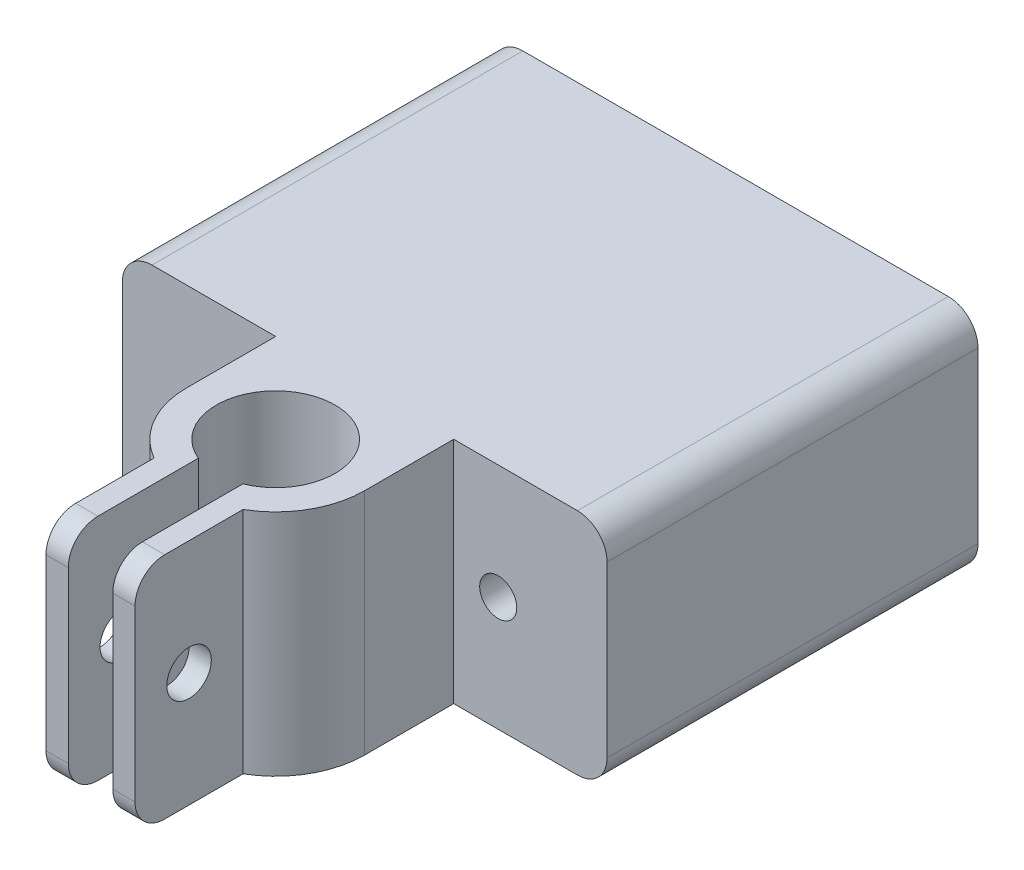
ISO-10303-21;
HEADER;
FILE_DESCRIPTION(('STEP AP214'),'2;1');
FILE_NAME('part.step','',(''),(''),'','','');
FILE_SCHEMA(('AUTOMOTIVE_DESIGN { 1 0 10303 214 1 1 1 1 }'));
ENDSEC;
DATA;
#1=APPLICATION_CONTEXT('core data for automotive mechanical design processes');
#2=APPLICATION_PROTOCOL_DEFINITION('international standard','automotive_design',2000,#1);
#3=PRODUCT_CONTEXT('',#1,'mechanical');
#4=PRODUCT('Part','Part','',(#3));
#5=PRODUCT_RELATED_PRODUCT_CATEGORY('part','',(#4));
#6=PRODUCT_DEFINITION_FORMATION('','',#4);
#7=PRODUCT_DEFINITION_CONTEXT('part definition',#1,'design');
#8=PRODUCT_DEFINITION('design','',#6,#7);
#9=PRODUCT_DEFINITION_SHAPE('','',#8);
#10=(LENGTH_UNIT() NAMED_UNIT(*) SI_UNIT(.MILLI.,.METRE.));
#11=(NAMED_UNIT(*) PLANE_ANGLE_UNIT() SI_UNIT($,.RADIAN.));
#12=(NAMED_UNIT(*) SI_UNIT($,.STERADIAN.) SOLID_ANGLE_UNIT());
#13=UNCERTAINTY_MEASURE_WITH_UNIT(LENGTH_MEASURE(1.E-05),#10,'distance_accuracy_value','');
#14=(GEOMETRIC_REPRESENTATION_CONTEXT(3) GLOBAL_UNCERTAINTY_ASSIGNED_CONTEXT((#13)) GLOBAL_UNIT_ASSIGNED_CONTEXT((#10,
#11,#12)) REPRESENTATION_CONTEXT('',''));
#15=CARTESIAN_POINT('',(0.,0.,0.));
#16=DIRECTION('',(0.,0.,1.));
#17=DIRECTION('',(1.,0.,0.));
#18=AXIS2_PLACEMENT_3D('',#15,#16,#17);
#19=CARTESIAN_POINT('',(-0.726697353279653,44.4640107272866,18.4811686631576));
#20=DIRECTION('',(0.,0.,1.));
#21=DIRECTION('',(1.,0.,0.));
#22=AXIS2_PLACEMENT_3D('',#19,#20,#21);
#23=PLANE('',#22);
#24=DIRECTION('',(0.,1.,0.));
#25=VECTOR('',#24,1.);
#26=CARTESIAN_POINT('',(-2.2266973532796,44.4640107272866,18.4811686631576));
#27=LINE('',#26,#25);
#28=CARTESIAN_POINT('',(-2.2266973532796,20.6420857532212,18.4811686631576));
#29=VERTEX_POINT('',#28);
#30=CARTESIAN_POINT('',(-2.2266973532796,32.0750636250568,18.4811686631576));
#31=VERTEX_POINT('',#30);
#32=EDGE_CURVE('E313',#29,#31,#27,.T.);
#33=ORIENTED_EDGE('',*,*,#32,.F.);
#34=DIRECTION('',(-1.,0.,0.));
#35=VECTOR('',#34,1.);
#36=CARTESIAN_POINT('',(-0.726697353279653,20.6420857532212,18.4811686631576));
#37=LINE('',#36,#35);
#38=CARTESIAN_POINT('',(-0.726697353279653,20.6420857532212,18.4811686631576));
#39=VERTEX_POINT('',#38);
#40=EDGE_CURVE('E68',#29,#39,#37,.F.);
#41=ORIENTED_EDGE('',*,*,#40,.T.);
#42=DIRECTION('',(0.,-1.,0.));
#43=VECTOR('',#42,1.);
#44=CARTESIAN_POINT('',(-0.726697353279653,44.4640107272866,18.4811686631576));
#45=LINE('',#44,#43);
#46=CARTESIAN_POINT('',(-0.726697353279653,32.0750636250568,18.4811686631576));
#47=VERTEX_POINT('',#46);
#48=EDGE_CURVE('E386',#47,#39,#45,.T.);
#49=ORIENTED_EDGE('',*,*,#48,.F.);
#50=DIRECTION('',(-1.,0.,0.));
#51=VECTOR('',#50,1.);
#52=CARTESIAN_POINT('',(-0.726697353279653,32.0750636250568,18.4811686631576));
#53=LINE('',#52,#51);
#54=EDGE_CURVE('E382',#47,#31,#53,.T.);
#55=ORIENTED_EDGE('',*,*,#54,.T.);
#56=EDGE_LOOP('',(#33,#41,#49,#55));
#57=FACE_BOUND('',#56,.T.);
#58=ADVANCED_FACE('F53',(#57),#23,.T.);
#59=CARTESIAN_POINT('',(-3.72669735327962,51.045626373534,6.));
#60=DIRECTION('',(0.,-1.,0.));
#61=DIRECTION('',(0.,0.,-1.));
#62=AXIS2_PLACEMENT_3D('',#59,#60,#61);
#63=CYLINDRICAL_SURFACE('',#62,6.);
#64=DIRECTION('',(0.,-1.,0.));
#65=VECTOR('',#64,1.);
#66=CARTESIAN_POINT('',(-6.72669735327967,51.045626373534,11.1961524227066));
#67=LINE('',#66,#65);
#68=CARTESIAN_POINT('',(-6.72669735327967,34.0750636250568,11.1961524227066));
#69=VERTEX_POINT('',#68);
#70=CARTESIAN_POINT('',(-6.72669735327967,18.6420857532212,11.1961524227066));
#71=VERTEX_POINT('',#70);
#72=EDGE_CURVE('E307',#69,#71,#67,.T.);
#73=ORIENTED_EDGE('',*,*,#72,.F.);
#74=CARTESIAN_POINT('',(-3.72669735327962,34.0750636250568,6.));
#75=DIRECTION('',(0.,1.,0.));
#76=DIRECTION('',(0.,0.,1.));
#77=AXIS2_PLACEMENT_3D('',#74,#75,#76);
#78=CIRCLE('',#77,6.);
#79=CARTESIAN_POINT('',(-9.72669735327963,34.0750636250568,6.));
#80=VERTEX_POINT('',#79);
#81=EDGE_CURVE('E254',#69,#80,#78,.F.);
#82=ORIENTED_EDGE('',*,*,#81,.T.);
#83=DIRECTION('',(0.,-1.,0.));
#84=VECTOR('',#83,1.);
#85=CARTESIAN_POINT('',(-9.72669735327963,42.5603449992954,6.));
#86=LINE('',#85,#84);
#87=CARTESIAN_POINT('',(-9.72669735327963,18.6420857532212,6.));
#88=VERTEX_POINT('',#87);
#89=EDGE_CURVE('E248',#80,#88,#86,.T.);
#90=ORIENTED_EDGE('',*,*,#89,.T.);
#91=CARTESIAN_POINT('',(-3.72669735327962,18.6420857532212,6.));
#92=DIRECTION('',(0.,-1.,0.));
#93=DIRECTION('',(0.,0.,-1.));
#94=AXIS2_PLACEMENT_3D('',#91,#92,#93);
#95=CIRCLE('',#94,6.);
#96=EDGE_CURVE('E245',#71,#88,#95,.T.);
#97=ORIENTED_EDGE('',*,*,#96,.F.);
#98=EDGE_LOOP('',(#73,#82,#90,#97));
#99=FACE_BOUND('',#98,.T.);
#100=ADVANCED_FACE('F505',(#99),#63,.T.);
#101=CARTESIAN_POINT('',(0.,0.,0.));
#102=DIRECTION('',(0.,0.,1.));
#103=DIRECTION('',(1.,0.,0.));
#104=AXIS2_PLACEMENT_3D('',#101,#102,#103);
#105=PLANE('',#104);
#106=CARTESIAN_POINT('',(5.27330264672038,26.358574689139,0.));
#107=DIRECTION('',(0.,0.,1.));
#108=DIRECTION('',(1.,0.,0.));
#109=AXIS2_PLACEMENT_3D('',#106,#107,#108);
#110=CIRCLE('',#109,1.25);
#111=CARTESIAN_POINT('',(6.52330264672038,26.358574689139,0.));
#112=VERTEX_POINT('',#111);
#113=EDGE_CURVE('E265',#112,#112,#110,.T.);
#114=ORIENTED_EDGE('',*,*,#113,.F.);
#115=EDGE_LOOP('',(#114));
#116=FACE_BOUND('',#115,.T.);
#117=DIRECTION('',(1.,0.,0.));
#118=VECTOR('',#117,1.);
#119=CARTESIAN_POINT('',(-20.0653915042754,18.6420857532212,0.));
#120=LINE('',#119,#118);
#121=CARTESIAN_POINT('',(2.27330264672038,18.6420857532212,0.));
#122=VERTEX_POINT('',#121);
#123=CARTESIAN_POINT('',(10.6119967977161,18.6420857532212,0.));
#124=VERTEX_POINT('',#123);
#125=EDGE_CURVE('E303',#122,#124,#120,.T.);
#126=ORIENTED_EDGE('',*,*,#125,.T.);
#127=CARTESIAN_POINT('',(10.6119967977161,20.6420857532212,0.));
#128=DIRECTION('',(0.,0.,1.));
#129=DIRECTION('',(1.,0.,0.));
#130=AXIS2_PLACEMENT_3D('',#127,#128,#129);
#131=CIRCLE('',#130,2.);
#132=CARTESIAN_POINT('',(12.6119967977161,20.6420857532212,0.));
#133=VERTEX_POINT('',#132);
#134=EDGE_CURVE('E328',#124,#133,#131,.T.);
#135=ORIENTED_EDGE('',*,*,#134,.T.);
#136=DIRECTION('',(0.,1.,0.));
#137=VECTOR('',#136,1.);
#138=CARTESIAN_POINT('',(12.6119967977161,34.0750636250568,0.));
#139=LINE('',#138,#137);
#140=CARTESIAN_POINT('',(12.6119967977161,32.0750636250568,0.));
#141=VERTEX_POINT('',#140);
#142=EDGE_CURVE('E272',#133,#141,#139,.T.);
#143=ORIENTED_EDGE('',*,*,#142,.T.);
#144=CARTESIAN_POINT('',(10.6119967977161,32.0750636250568,0.));
#145=DIRECTION('',(0.,0.,1.));
#146=DIRECTION('',(1.,0.,0.));
#147=AXIS2_PLACEMENT_3D('',#144,#145,#146);
#148=CIRCLE('',#147,2.);
#149=CARTESIAN_POINT('',(10.6119967977161,34.0750636250568,0.));
#150=VERTEX_POINT('',#149);
#151=EDGE_CURVE('E326',#141,#150,#148,.T.);
#152=ORIENTED_EDGE('',*,*,#151,.T.);
#153=DIRECTION('',(-1.,0.,0.));
#154=VECTOR('',#153,1.);
#155=CARTESIAN_POINT('',(-20.0653915042754,34.0750636250568,0.));
#156=LINE('',#155,#154);
#157=CARTESIAN_POINT('',(2.27330264672038,34.0750636250568,0.));
#158=VERTEX_POINT('',#157);
#159=EDGE_CURVE('E298',#150,#158,#156,.T.);
#160=ORIENTED_EDGE('',*,*,#159,.T.);
#161=DIRECTION('',(0.,-1.,0.));
#162=VECTOR('',#161,1.);
#163=CARTESIAN_POINT('',(2.27330264672038,42.5603449992954,0.));
#164=LINE('',#163,#162);
#165=EDGE_CURVE('E257',#158,#122,#164,.T.);
#166=ORIENTED_EDGE('',*,*,#165,.T.);
#167=EDGE_LOOP('',(#126,#135,#143,#152,#160,#166));
#168=FACE_BOUND('',#167,.T.);
#169=ADVANCED_FACE('F464',(#116,#168),#105,.T.);
#170=CARTESIAN_POINT('',(12.6119967977161,34.0750636250568,-25.));
#171=DIRECTION('',(1.,0.,0.));
#172=DIRECTION('',(0.,0.,-1.));
#173=AXIS2_PLACEMENT_3D('',#170,#171,#172);
#174=PLANE('',#173);
#175=ORIENTED_EDGE('',*,*,#142,.F.);
#176=DIRECTION('',(0.,0.,1.));
#177=VECTOR('',#176,1.);
#178=CARTESIAN_POINT('',(12.6119967977161,20.6420857532212,-25.));
#179=LINE('',#178,#177);
#180=CARTESIAN_POINT('',(12.6119967977161,20.6420857532212,-25.));
#181=VERTEX_POINT('',#180);
#182=EDGE_CURVE('E333',#133,#181,#179,.F.);
#183=ORIENTED_EDGE('',*,*,#182,.T.);
#184=DIRECTION('',(0.,1.,0.));
#185=VECTOR('',#184,1.);
#186=CARTESIAN_POINT('',(12.6119967977161,34.0750636250568,-25.));
#187=LINE('',#186,#185);
#188=CARTESIAN_POINT('',(12.6119967977161,32.0750636250568,-25.));
#189=VERTEX_POINT('',#188);
#190=EDGE_CURVE('E281',#181,#189,#187,.T.);
#191=ORIENTED_EDGE('',*,*,#190,.T.);
#192=DIRECTION('',(0.,0.,1.));
#193=VECTOR('',#192,1.);
#194=CARTESIAN_POINT('',(12.6119967977161,32.0750636250568,-25.));
#195=LINE('',#194,#193);
#196=EDGE_CURVE('E330',#189,#141,#195,.T.);
#197=ORIENTED_EDGE('',*,*,#196,.T.);
#198=EDGE_LOOP('',(#175,#183,#191,#197));
#199=FACE_BOUND('',#198,.T.);
#200=ADVANCED_FACE('F456',(#199),#174,.T.);
#201=CARTESIAN_POINT('',(-20.0653915042754,18.6420857532212,-25.));
#202=DIRECTION('',(0.,-1.,0.));
#203=DIRECTION('',(0.,0.,-1.));
#204=AXIS2_PLACEMENT_3D('',#201,#202,#203);
#205=PLANE('',#204);
#206=DIRECTION('',(0.,0.,-1.));
#207=VECTOR('',#206,1.);
#208=CARTESIAN_POINT('',(-5.22669735327965,18.6420857532212,6.));
#209=LINE('',#208,#207);
#210=CARTESIAN_POINT('',(-5.22669735327965,18.6420857532212,16.4811686631576));
#211=VERTEX_POINT('',#210);
#212=CARTESIAN_POINT('',(-5.22669735327965,18.6420857532212,9.70809924354782));
#213=VERTEX_POINT('',#212);
#214=EDGE_CURVE('E236',#211,#213,#209,.T.);
#215=ORIENTED_EDGE('',*,*,#214,.F.);
#216=DIRECTION('',(-1.,0.,0.));
#217=VECTOR('',#216,1.);
#218=CARTESIAN_POINT('',(-20.0653915042754,18.6420857532212,16.4811686631576));
#219=LINE('',#218,#217);
#220=CARTESIAN_POINT('',(-6.72669735327967,18.6420857532212,16.4811686631576));
#221=VERTEX_POINT('',#220);
#222=EDGE_CURVE('E375',#211,#221,#219,.T.);
#223=ORIENTED_EDGE('',*,*,#222,.T.);
#224=DIRECTION('',(0.,0.,-1.));
#225=VECTOR('',#224,1.);
#226=CARTESIAN_POINT('',(-6.72669735327967,18.6420857532212,10.));
#227=LINE('',#226,#225);
#228=EDGE_CURVE('E394',#221,#71,#227,.T.);
#229=ORIENTED_EDGE('',*,*,#228,.T.);
#230=ORIENTED_EDGE('',*,*,#96,.T.);
#231=DIRECTION('',(0.,0.,-1.));
#232=VECTOR('',#231,1.);
#233=CARTESIAN_POINT('',(-9.72669735327963,18.6420857532212,6.));
#234=LINE('',#233,#232);
#235=CARTESIAN_POINT('',(-9.72669735327963,18.6420857532212,0.));
#236=VERTEX_POINT('',#235);
#237=EDGE_CURVE('E243',#88,#236,#234,.T.);
#238=ORIENTED_EDGE('',*,*,#237,.T.);
#239=CARTESIAN_POINT('',(-18.0653915042754,18.6420857532212,0.));
#240=VERTEX_POINT('',#239);
#241=EDGE_CURVE('E285',#240,#236,#120,.T.);
#242=ORIENTED_EDGE('',*,*,#241,.F.);
#243=DIRECTION('',(0.,0.,1.));
#244=VECTOR('',#243,1.);
#245=CARTESIAN_POINT('',(-18.0653915042754,18.6420857532212,-25.));
#246=LINE('',#245,#244);
#247=CARTESIAN_POINT('',(-18.0653915042754,18.6420857532212,-25.));
#248=VERTEX_POINT('',#247);
#249=EDGE_CURVE('E316',#240,#248,#246,.F.);
#250=ORIENTED_EDGE('',*,*,#249,.T.);
#251=DIRECTION('',(1.,0.,0.));
#252=VECTOR('',#251,1.);
#253=CARTESIAN_POINT('',(-20.0653915042754,18.6420857532212,-25.));
#254=LINE('',#253,#252);
#255=CARTESIAN_POINT('',(10.6119967977161,18.6420857532212,-25.));
#256=VERTEX_POINT('',#255);
#257=EDGE_CURVE('E291',#248,#256,#254,.T.);
#258=ORIENTED_EDGE('',*,*,#257,.T.);
#259=DIRECTION('',(0.,0.,1.));
#260=VECTOR('',#259,1.);
#261=CARTESIAN_POINT('',(10.6119967977161,18.6420857532212,-25.));
#262=LINE('',#261,#260);
#263=EDGE_CURVE('E323',#256,#124,#262,.T.);
#264=ORIENTED_EDGE('',*,*,#263,.T.);
#265=ORIENTED_EDGE('',*,*,#125,.F.);
#266=DIRECTION('',(0.,0.,-1.));
#267=VECTOR('',#266,1.);
#268=CARTESIAN_POINT('',(2.27330264672038,18.6420857532212,6.));
#269=LINE('',#268,#267);
#270=CARTESIAN_POINT('',(2.27330264672038,18.6420857532212,6.));
#271=VERTEX_POINT('',#270);
#272=EDGE_CURVE('E258',#271,#122,#269,.T.);
#273=ORIENTED_EDGE('',*,*,#272,.F.);
#274=CARTESIAN_POINT('',(-0.726697353279651,18.6420857532212,11.1961524227066));
#275=VERTEX_POINT('',#274);
#276=EDGE_CURVE('E251',#271,#275,#95,.T.);
#277=ORIENTED_EDGE('',*,*,#276,.T.);
#278=DIRECTION('',(0.,0.,1.));
#279=VECTOR('',#278,1.);
#280=CARTESIAN_POINT('',(-0.726697353279652,18.6420857532212,10.));
#281=LINE('',#280,#279);
#282=CARTESIAN_POINT('',(-0.726697353279653,18.6420857532212,16.4811686631576));
#283=VERTEX_POINT('',#282);
#284=EDGE_CURVE('E224',#275,#283,#281,.T.);
#285=ORIENTED_EDGE('',*,*,#284,.T.);
#286=DIRECTION('',(-1.,0.,0.));
#287=VECTOR('',#286,1.);
#288=CARTESIAN_POINT('',(-20.0653915042754,18.6420857532212,16.4811686631576));
#289=LINE('',#288,#287);
#290=CARTESIAN_POINT('',(-2.2266973532796,18.6420857532212,16.4811686631576));
#291=VERTEX_POINT('',#290);
#292=EDGE_CURVE('E235',#283,#291,#289,.T.);
#293=ORIENTED_EDGE('',*,*,#292,.T.);
#294=DIRECTION('',(0.,0.,1.));
#295=VECTOR('',#294,1.);
#296=CARTESIAN_POINT('',(-2.2266973532796,18.6420857532212,6.));
#297=LINE('',#296,#295);
#298=CARTESIAN_POINT('',(-2.2266973532796,18.6420857532212,9.70809924354782));
#299=VERTEX_POINT('',#298);
#300=EDGE_CURVE('E217',#299,#291,#297,.T.);
#301=ORIENTED_EDGE('',*,*,#300,.F.);
#302=CARTESIAN_POINT('',(-3.72669735327962,18.6420857532212,6.));
#303=DIRECTION('',(0.,-1.,0.));
#304=DIRECTION('',(0.,0.,-1.));
#305=AXIS2_PLACEMENT_3D('',#302,#303,#304);
#306=CIRCLE('',#305,4.);
#307=EDGE_CURVE('E232',#213,#299,#306,.T.);
#308=ORIENTED_EDGE('',*,*,#307,.F.);
#309=EDGE_LOOP('',(#215,#223,#229,#230,#238,#242,#250,#258,#264,#265,#273,#277,#285,#293,#301,#308));
#310=FACE_BOUND('',#309,.T.);
#311=ADVANCED_FACE('F231',(#310),#205,.T.);
#312=CARTESIAN_POINT('',(-20.0653915042754,34.0750636250568,-25.));
#313=DIRECTION('',(-1.,0.,0.));
#314=DIRECTION('',(0.,0.,1.));
#315=AXIS2_PLACEMENT_3D('',#312,#313,#314);
#316=PLANE('',#315);
#317=DIRECTION('',(0.,-1.,0.));
#318=VECTOR('',#317,1.);
#319=CARTESIAN_POINT('',(-20.0653915042754,34.0750636250568,-25.));
#320=LINE('',#319,#318);
#321=CARTESIAN_POINT('',(-20.0653915042754,32.0750636250568,-25.));
#322=VERTEX_POINT('',#321);
#323=CARTESIAN_POINT('',(-20.0653915042754,20.6420857532212,-25.));
#324=VERTEX_POINT('',#323);
#325=EDGE_CURVE('E288',#322,#324,#320,.T.);
#326=ORIENTED_EDGE('',*,*,#325,.T.);
#327=DIRECTION('',(0.,0.,1.));
#328=VECTOR('',#327,1.);
#329=CARTESIAN_POINT('',(-20.0653915042754,20.6420857532212,-25.));
#330=LINE('',#329,#328);
#331=CARTESIAN_POINT('',(-20.0653915042754,20.6420857532212,0.));
#332=VERTEX_POINT('',#331);
#333=EDGE_CURVE('E350',#324,#332,#330,.T.);
#334=ORIENTED_EDGE('',*,*,#333,.T.);
#335=DIRECTION('',(0.,-1.,0.));
#336=VECTOR('',#335,1.);
#337=CARTESIAN_POINT('',(-20.0653915042754,34.0750636250568,0.));
#338=LINE('',#337,#336);
#339=CARTESIAN_POINT('',(-20.0653915042754,32.0750636250568,0.));
#340=VERTEX_POINT('',#339);
#341=EDGE_CURVE('E300',#340,#332,#338,.T.);
#342=ORIENTED_EDGE('',*,*,#341,.F.);
#343=DIRECTION('',(0.,0.,1.));
#344=VECTOR('',#343,1.);
#345=CARTESIAN_POINT('',(-20.0653915042754,32.0750636250568,-25.));
#346=LINE('',#345,#344);
#347=EDGE_CURVE('E348',#340,#322,#346,.F.);
#348=ORIENTED_EDGE('',*,*,#347,.T.);
#349=EDGE_LOOP('',(#326,#334,#342,#348));
#350=FACE_BOUND('',#349,.T.);
#351=ADVANCED_FACE('F442',(#350),#316,.T.);
#352=CARTESIAN_POINT('',(-20.0653915042754,34.0750636250568,-25.));
#353=DIRECTION('',(0.,1.,0.));
#354=DIRECTION('',(0.,0.,1.));
#355=AXIS2_PLACEMENT_3D('',#352,#353,#354);
#356=PLANE('',#355);
#357=DIRECTION('',(0.,0.,-1.));
#358=VECTOR('',#357,1.);
#359=CARTESIAN_POINT('',(-6.72669735327967,34.0750636250568,10.));
#360=LINE('',#359,#358);
#361=CARTESIAN_POINT('',(-6.72669735327967,34.0750636250568,16.4811686631576));
#362=VERTEX_POINT('',#361);
#363=EDGE_CURVE('E401',#362,#69,#360,.T.);
#364=ORIENTED_EDGE('',*,*,#363,.F.);
#365=DIRECTION('',(-1.,0.,0.));
#366=VECTOR('',#365,1.);
#367=CARTESIAN_POINT('',(-20.0653915042754,34.0750636250568,16.4811686631576));
#368=LINE('',#367,#366);
#369=CARTESIAN_POINT('',(-5.22669735327965,34.0750636250568,16.4811686631576));
#370=VERTEX_POINT('',#369);
#371=EDGE_CURVE('E368',#362,#370,#368,.F.);
#372=ORIENTED_EDGE('',*,*,#371,.T.);
#373=DIRECTION('',(0.,0.,-1.));
#374=VECTOR('',#373,1.);
#375=CARTESIAN_POINT('',(-5.22669735327965,34.0750636250568,6.));
#376=LINE('',#375,#374);
#377=CARTESIAN_POINT('',(-5.22669735327965,34.0750636250568,9.70809924354782));
#378=VERTEX_POINT('',#377);
#379=EDGE_CURVE('E474',#370,#378,#376,.T.);
#380=ORIENTED_EDGE('',*,*,#379,.T.);
#381=CARTESIAN_POINT('',(-3.72669735327962,34.0750636250568,6.));
#382=DIRECTION('',(0.,-1.,0.));
#383=DIRECTION('',(0.,0.,-1.));
#384=AXIS2_PLACEMENT_3D('',#381,#382,#383);
#385=CIRCLE('',#384,4.);
#386=CARTESIAN_POINT('',(-2.2266973532796,34.0750636250568,9.70809924354782));
#387=VERTEX_POINT('',#386);
#388=EDGE_CURVE('E242',#378,#387,#385,.T.);
#389=ORIENTED_EDGE('',*,*,#388,.T.);
#390=DIRECTION('',(0.,0.,1.));
#391=VECTOR('',#390,1.);
#392=CARTESIAN_POINT('',(-2.2266973532796,34.0750636250568,6.));
#393=LINE('',#392,#391);
#394=CARTESIAN_POINT('',(-2.2266973532796,34.0750636250568,16.4811686631576));
#395=VERTEX_POINT('',#394);
#396=EDGE_CURVE('E219',#387,#395,#393,.T.);
#397=ORIENTED_EDGE('',*,*,#396,.T.);
#398=DIRECTION('',(-1.,0.,0.));
#399=VECTOR('',#398,1.);
#400=CARTESIAN_POINT('',(-20.0653915042754,34.0750636250568,16.4811686631576));
#401=LINE('',#400,#399);
#402=CARTESIAN_POINT('',(-0.726697353279653,34.0750636250568,16.4811686631576));
#403=VERTEX_POINT('',#402);
#404=EDGE_CURVE('E366',#395,#403,#401,.F.);
#405=ORIENTED_EDGE('',*,*,#404,.T.);
#406=DIRECTION('',(0.,0.,1.));
#407=VECTOR('',#406,1.);
#408=CARTESIAN_POINT('',(-0.726697353279652,34.0750636250568,10.));
#409=LINE('',#408,#407);
#410=CARTESIAN_POINT('',(-0.726697353279652,34.0750636250568,11.1961524227066));
#411=VERTEX_POINT('',#410);
#412=EDGE_CURVE('E399',#411,#403,#409,.T.);
#413=ORIENTED_EDGE('',*,*,#412,.F.);
#414=CARTESIAN_POINT('',(2.27330264672038,34.0750636250568,6.));
#415=VERTEX_POINT('',#414);
#416=EDGE_CURVE('E255',#415,#411,#78,.F.);
#417=ORIENTED_EDGE('',*,*,#416,.F.);
#418=DIRECTION('',(0.,0.,-1.));
#419=VECTOR('',#418,1.);
#420=CARTESIAN_POINT('',(2.27330264672038,34.0750636250568,6.));
#421=LINE('',#420,#419);
#422=EDGE_CURVE('E261',#415,#158,#421,.T.);
#423=ORIENTED_EDGE('',*,*,#422,.T.);
#424=ORIENTED_EDGE('',*,*,#159,.F.);
#425=DIRECTION('',(0.,0.,1.));
#426=VECTOR('',#425,1.);
#427=CARTESIAN_POINT('',(10.6119967977161,34.0750636250568,-25.));
#428=LINE('',#427,#426);
#429=CARTESIAN_POINT('',(10.6119967977161,34.0750636250568,-25.));
#430=VERTEX_POINT('',#429);
#431=EDGE_CURVE('E346',#150,#430,#428,.F.);
#432=ORIENTED_EDGE('',*,*,#431,.T.);
#433=DIRECTION('',(-1.,0.,0.));
#434=VECTOR('',#433,1.);
#435=CARTESIAN_POINT('',(-20.0653915042754,34.0750636250568,-25.));
#436=LINE('',#435,#434);
#437=CARTESIAN_POINT('',(-18.0653915042754,34.0750636250568,-25.));
#438=VERTEX_POINT('',#437);
#439=EDGE_CURVE('E284',#430,#438,#436,.T.);
#440=ORIENTED_EDGE('',*,*,#439,.T.);
#441=DIRECTION('',(0.,0.,1.));
#442=VECTOR('',#441,1.);
#443=CARTESIAN_POINT('',(-18.0653915042754,34.0750636250568,-25.));
#444=LINE('',#443,#442);
#445=CARTESIAN_POINT('',(-18.0653915042754,34.0750636250568,0.));
#446=VERTEX_POINT('',#445);
#447=EDGE_CURVE('E343',#438,#446,#444,.T.);
#448=ORIENTED_EDGE('',*,*,#447,.T.);
#449=CARTESIAN_POINT('',(-9.72669735327963,34.0750636250568,0.));
#450=VERTEX_POINT('',#449);
#451=EDGE_CURVE('E297',#450,#446,#156,.T.);
#452=ORIENTED_EDGE('',*,*,#451,.F.);
#453=DIRECTION('',(0.,0.,-1.));
#454=VECTOR('',#453,1.);
#455=CARTESIAN_POINT('',(-9.72669735327963,34.0750636250568,6.));
#456=LINE('',#455,#454);
#457=EDGE_CURVE('E409',#80,#450,#456,.T.);
#458=ORIENTED_EDGE('',*,*,#457,.F.);
#459=ORIENTED_EDGE('',*,*,#81,.F.);
#460=EDGE_LOOP('',(#364,#372,#380,#389,#397,#405,#413,#417,#423,#424,#432,#440,#448,#452,#458,#459));
#461=FACE_BOUND('',#460,.T.);
#462=ADVANCED_FACE('F422',(#461),#356,.T.);
#463=CARTESIAN_POINT('',(0.,0.,-25.));
#464=DIRECTION('',(0.,0.,1.));
#465=DIRECTION('',(1.,0.,0.));
#466=AXIS2_PLACEMENT_3D('',#463,#464,#465);
#467=PLANE('',#466);
#468=CARTESIAN_POINT('',(-12.7266973532796,26.358574689139,-25.));
#469=DIRECTION('',(0.,0.,1.));
#470=DIRECTION('',(1.,0.,0.));
#471=AXIS2_PLACEMENT_3D('',#468,#469,#470);
#472=CIRCLE('',#471,1.25);
#473=CARTESIAN_POINT('',(-11.4766973532796,26.358574689139,-25.));
#474=VERTEX_POINT('',#473);
#475=EDGE_CURVE('E269',#474,#474,#472,.T.);
#476=ORIENTED_EDGE('',*,*,#475,.T.);
#477=EDGE_LOOP('',(#476));
#478=FACE_BOUND('',#477,.T.);
#479=CARTESIAN_POINT('',(5.27330264672038,26.358574689139,-25.));
#480=DIRECTION('',(0.,0.,1.));
#481=DIRECTION('',(1.,0.,0.));
#482=AXIS2_PLACEMENT_3D('',#479,#480,#481);
#483=CIRCLE('',#482,1.25);
#484=CARTESIAN_POINT('',(6.52330264672038,26.358574689139,-25.));
#485=VERTEX_POINT('',#484);
#486=EDGE_CURVE('E276',#485,#485,#483,.T.);
#487=ORIENTED_EDGE('',*,*,#486,.T.);
#488=EDGE_LOOP('',(#487));
#489=FACE_BOUND('',#488,.T.);
#490=ORIENTED_EDGE('',*,*,#190,.F.);
#491=CARTESIAN_POINT('',(10.6119967977161,20.6420857532212,-25.));
#492=DIRECTION('',(0.,0.,1.));
#493=DIRECTION('',(1.,0.,0.));
#494=AXIS2_PLACEMENT_3D('',#491,#492,#493);
#495=CIRCLE('',#494,2.);
#496=EDGE_CURVE('E341',#181,#256,#495,.F.);
#497=ORIENTED_EDGE('',*,*,#496,.T.);
#498=ORIENTED_EDGE('',*,*,#257,.F.);
#499=CARTESIAN_POINT('',(-18.0653915042754,20.6420857532212,-25.));
#500=DIRECTION('',(0.,0.,1.));
#501=DIRECTION('',(1.,0.,0.));
#502=AXIS2_PLACEMENT_3D('',#499,#500,#501);
#503=CIRCLE('',#502,2.);
#504=EDGE_CURVE('E337',#248,#324,#503,.F.);
#505=ORIENTED_EDGE('',*,*,#504,.T.);
#506=ORIENTED_EDGE('',*,*,#325,.F.);
#507=CARTESIAN_POINT('',(-18.0653915042754,32.0750636250568,-25.));
#508=DIRECTION('',(0.,0.,1.));
#509=DIRECTION('',(1.,0.,0.));
#510=AXIS2_PLACEMENT_3D('',#507,#508,#509);
#511=CIRCLE('',#510,2.);
#512=EDGE_CURVE('E335',#322,#438,#511,.F.);
#513=ORIENTED_EDGE('',*,*,#512,.T.);
#514=ORIENTED_EDGE('',*,*,#439,.F.);
#515=CARTESIAN_POINT('',(10.6119967977161,32.0750636250568,-25.));
#516=DIRECTION('',(0.,0.,1.));
#517=DIRECTION('',(1.,0.,0.));
#518=AXIS2_PLACEMENT_3D('',#515,#516,#517);
#519=CIRCLE('',#518,2.);
#520=EDGE_CURVE('E339',#430,#189,#519,.F.);
#521=ORIENTED_EDGE('',*,*,#520,.T.);
#522=EDGE_LOOP('',(#490,#497,#498,#505,#506,#513,#514,#521));
#523=FACE_BOUND('',#522,.T.);
#524=ADVANCED_FACE('F439',(#478,#489,#523),#467,.F.);
#525=ORIENTED_EDGE('',*,*,#341,.T.);
#526=CARTESIAN_POINT('',(-18.0653915042754,20.6420857532212,0.));
#527=DIRECTION('',(0.,0.,1.));
#528=DIRECTION('',(1.,0.,0.));
#529=AXIS2_PLACEMENT_3D('',#526,#527,#528);
#530=CIRCLE('',#529,2.);
#531=EDGE_CURVE('E355',#332,#240,#530,.T.);
#532=ORIENTED_EDGE('',*,*,#531,.T.);
#533=ORIENTED_EDGE('',*,*,#241,.T.);
#534=DIRECTION('',(0.,-1.,0.));
#535=VECTOR('',#534,1.);
#536=CARTESIAN_POINT('',(-9.72669735327963,42.5603449992954,0.));
#537=LINE('',#536,#535);
#538=EDGE_CURVE('E406',#450,#236,#537,.T.);
#539=ORIENTED_EDGE('',*,*,#538,.F.);
#540=ORIENTED_EDGE('',*,*,#451,.T.);
#541=CARTESIAN_POINT('',(-18.0653915042754,32.0750636250568,0.));
#542=DIRECTION('',(0.,0.,1.));
#543=DIRECTION('',(1.,0.,0.));
#544=AXIS2_PLACEMENT_3D('',#541,#542,#543);
#545=CIRCLE('',#544,2.);
#546=EDGE_CURVE('E353',#446,#340,#545,.T.);
#547=ORIENTED_EDGE('',*,*,#546,.T.);
#548=EDGE_LOOP('',(#525,#532,#533,#539,#540,#547));
#549=FACE_BOUND('',#548,.T.);
#550=CARTESIAN_POINT('',(-12.7266973532796,26.358574689139,0.));
#551=DIRECTION('',(0.,0.,1.));
#552=DIRECTION('',(1.,0.,0.));
#553=AXIS2_PLACEMENT_3D('',#550,#551,#552);
#554=CIRCLE('',#553,1.25);
#555=CARTESIAN_POINT('',(-11.4766973532796,26.358574689139,0.));
#556=VERTEX_POINT('',#555);
#557=EDGE_CURVE('E273',#556,#556,#554,.T.);
#558=ORIENTED_EDGE('',*,*,#557,.F.);
#559=EDGE_LOOP('',(#558));
#560=FACE_BOUND('',#559,.T.);
#561=ADVANCED_FACE('F426',(#549,#560),#105,.T.);
#562=CARTESIAN_POINT('',(5.27330264672038,26.358574689139,-25.));
#563=DIRECTION('',(0.,0.,1.));
#564=DIRECTION('',(1.,0.,0.));
#565=AXIS2_PLACEMENT_3D('',#562,#563,#564);
#566=CYLINDRICAL_SURFACE('',#565,1.25);
#567=ORIENTED_EDGE('',*,*,#486,.F.);
#568=EDGE_LOOP('',(#567));
#569=FACE_BOUND('',#568,.T.);
#570=ORIENTED_EDGE('',*,*,#113,.T.);
#571=EDGE_LOOP('',(#570));
#572=FACE_BOUND('',#571,.T.);
#573=ADVANCED_FACE('F563',(#569,#572),#566,.F.);
#574=CARTESIAN_POINT('',(-12.7266973532796,26.358574689139,-25.));
#575=DIRECTION('',(0.,0.,1.));
#576=DIRECTION('',(1.,0.,0.));
#577=AXIS2_PLACEMENT_3D('',#574,#575,#576);
#578=CYLINDRICAL_SURFACE('',#577,1.25);
#579=ORIENTED_EDGE('',*,*,#475,.F.);
#580=EDGE_LOOP('',(#579));
#581=FACE_BOUND('',#580,.T.);
#582=ORIENTED_EDGE('',*,*,#557,.T.);
#583=EDGE_LOOP('',(#582));
#584=FACE_BOUND('',#583,.T.);
#585=ADVANCED_FACE('F569',(#581,#584),#578,.F.);
#586=CARTESIAN_POINT('',(2.27330264672038,42.5603449992954,6.));
#587=DIRECTION('',(-1.,0.,0.));
#588=DIRECTION('',(0.,0.,1.));
#589=AXIS2_PLACEMENT_3D('',#586,#587,#588);
#590=PLANE('',#589);
#591=ORIENTED_EDGE('',*,*,#422,.F.);
#592=DIRECTION('',(0.,-1.,0.));
#593=VECTOR('',#592,1.);
#594=CARTESIAN_POINT('',(2.27330264672038,42.5603449992954,6.));
#595=LINE('',#594,#593);
#596=EDGE_CURVE('E262',#415,#271,#595,.T.);
#597=ORIENTED_EDGE('',*,*,#596,.T.);
#598=ORIENTED_EDGE('',*,*,#272,.T.);
#599=ORIENTED_EDGE('',*,*,#165,.F.);
#600=EDGE_LOOP('',(#591,#597,#598,#599));
#601=FACE_BOUND('',#600,.T.);
#602=ADVANCED_FACE('F468',(#601),#590,.F.);
#603=DIRECTION('',(0.,-1.,0.));
#604=VECTOR('',#603,1.);
#605=CARTESIAN_POINT('',(-0.726697353279652,51.045626373534,11.1961524227066));
#606=LINE('',#605,#604);
#607=EDGE_CURVE('E294',#275,#411,#606,.F.);
#608=ORIENTED_EDGE('',*,*,#607,.F.);
#609=ORIENTED_EDGE('',*,*,#276,.F.);
#610=ORIENTED_EDGE('',*,*,#596,.F.);
#611=ORIENTED_EDGE('',*,*,#416,.T.);
#612=EDGE_LOOP('',(#608,#609,#610,#611));
#613=FACE_BOUND('',#612,.T.);
#614=ADVANCED_FACE('F472',(#613),#63,.T.);
#615=CARTESIAN_POINT('',(-3.72669735327962,34.0750636250568,6.));
#616=DIRECTION('',(0.,-1.,0.));
#617=DIRECTION('',(0.,0.,-1.));
#618=AXIS2_PLACEMENT_3D('',#615,#616,#617);
#619=CYLINDRICAL_SURFACE('',#618,4.);
#620=ORIENTED_EDGE('',*,*,#307,.T.);
#621=DIRECTION('',(0.,-1.,0.));
#622=VECTOR('',#621,1.);
#623=CARTESIAN_POINT('',(-2.2266973532796,34.0750636250568,9.70809924354782));
#624=LINE('',#623,#622);
#625=EDGE_CURVE('E214',#299,#387,#624,.F.);
#626=ORIENTED_EDGE('',*,*,#625,.T.);
#627=ORIENTED_EDGE('',*,*,#388,.F.);
#628=DIRECTION('',(0.,-1.,0.));
#629=VECTOR('',#628,1.);
#630=CARTESIAN_POINT('',(-5.22669735327965,34.0750636250568,9.70809924354782));
#631=LINE('',#630,#629);
#632=EDGE_CURVE('E225',#378,#213,#631,.T.);
#633=ORIENTED_EDGE('',*,*,#632,.T.);
#634=EDGE_LOOP('',(#620,#626,#627,#633));
#635=FACE_BOUND('',#634,.T.);
#636=ADVANCED_FACE('F240',(#635),#619,.F.);
#637=CARTESIAN_POINT('',(-9.72669735327963,42.5603449992954,6.));
#638=DIRECTION('',(-1.,0.,0.));
#639=DIRECTION('',(0.,0.,1.));
#640=AXIS2_PLACEMENT_3D('',#637,#638,#639);
#641=PLANE('',#640);
#642=ORIENTED_EDGE('',*,*,#89,.F.);
#643=ORIENTED_EDGE('',*,*,#457,.T.);
#644=ORIENTED_EDGE('',*,*,#538,.T.);
#645=ORIENTED_EDGE('',*,*,#237,.F.);
#646=EDGE_LOOP('',(#642,#643,#644,#645));
#647=FACE_BOUND('',#646,.T.);
#648=ADVANCED_FACE('F416',(#647),#641,.T.);
#649=DIRECTION('',(0.,-1.,0.));
#650=VECTOR('',#649,1.);
#651=CARTESIAN_POINT('',(-5.22669735327965,44.4640107272866,18.4811686631576));
#652=LINE('',#651,#650);
#653=CARTESIAN_POINT('',(-5.22669735327965,32.0750636250568,18.4811686631576));
#654=VERTEX_POINT('',#653);
#655=CARTESIAN_POINT('',(-5.22669735327965,20.6420857532212,18.4811686631576));
#656=VERTEX_POINT('',#655);
#657=EDGE_CURVE('E310',#654,#656,#652,.T.);
#658=ORIENTED_EDGE('',*,*,#657,.F.);
#659=DIRECTION('',(-1.,0.,0.));
#660=VECTOR('',#659,1.);
#661=CARTESIAN_POINT('',(-0.726697353279653,32.0750636250568,18.4811686631576));
#662=LINE('',#661,#660);
#663=CARTESIAN_POINT('',(-6.72669735327967,32.0750636250568,18.4811686631576));
#664=VERTEX_POINT('',#663);
#665=EDGE_CURVE('E359',#654,#664,#662,.T.);
#666=ORIENTED_EDGE('',*,*,#665,.T.);
#667=DIRECTION('',(0.,-1.,0.));
#668=VECTOR('',#667,1.);
#669=CARTESIAN_POINT('',(-6.72669735327967,44.4640107272866,18.4811686631576));
#670=LINE('',#669,#668);
#671=CARTESIAN_POINT('',(-6.72669735327967,20.6420857532212,18.4811686631576));
#672=VERTEX_POINT('',#671);
#673=EDGE_CURVE('E396',#664,#672,#670,.T.);
#674=ORIENTED_EDGE('',*,*,#673,.T.);
#675=DIRECTION('',(-1.,0.,0.));
#676=VECTOR('',#675,1.);
#677=CARTESIAN_POINT('',(-0.726697353279653,20.6420857532212,18.4811686631576));
#678=LINE('',#677,#676);
#679=EDGE_CURVE('E357',#672,#656,#678,.F.);
#680=ORIENTED_EDGE('',*,*,#679,.T.);
#681=EDGE_LOOP('',(#658,#666,#674,#680));
#682=FACE_BOUND('',#681,.T.);
#683=ADVANCED_FACE('F500',(#682),#23,.T.);
#684=CARTESIAN_POINT('',(-6.72669735327967,44.4640107272866,10.));
#685=DIRECTION('',(-1.,0.,0.));
#686=DIRECTION('',(0.,0.,1.));
#687=AXIS2_PLACEMENT_3D('',#684,#685,#686);
#688=PLANE('',#687);
#689=CARTESIAN_POINT('',(-6.72669735327967,26.358574689139,14.8386605429321));
#690=DIRECTION('',(-1.,0.,0.));
#691=DIRECTION('',(0.,0.,1.));
#692=AXIS2_PLACEMENT_3D('',#689,#690,#691);
#693=CIRCLE('',#692,1.5);
#694=CARTESIAN_POINT('',(-6.72669735327967,26.358574689139,16.3386605429321));
#695=VERTEX_POINT('',#694);
#696=EDGE_CURVE('E237',#695,#695,#693,.T.);
#697=ORIENTED_EDGE('',*,*,#696,.F.);
#698=EDGE_LOOP('',(#697));
#699=FACE_BOUND('',#698,.T.);
#700=ORIENTED_EDGE('',*,*,#673,.F.);
#701=CARTESIAN_POINT('',(-6.72669735327967,32.0750636250568,16.4811686631576));
#702=DIRECTION('',(-1.,0.,0.));
#703=DIRECTION('',(0.,0.,1.));
#704=AXIS2_PLACEMENT_3D('',#701,#702,#703);
#705=CIRCLE('',#704,2.);
#706=EDGE_CURVE('E364',#664,#362,#705,.T.);
#707=ORIENTED_EDGE('',*,*,#706,.T.);
#708=ORIENTED_EDGE('',*,*,#363,.T.);
#709=ORIENTED_EDGE('',*,*,#72,.T.);
#710=ORIENTED_EDGE('',*,*,#228,.F.);
#711=CARTESIAN_POINT('',(-6.72669735327967,20.6420857532212,16.4811686631576));
#712=DIRECTION('',(-1.,0.,0.));
#713=DIRECTION('',(0.,0.,1.));
#714=AXIS2_PLACEMENT_3D('',#711,#712,#713);
#715=CIRCLE('',#714,2.);
#716=EDGE_CURVE('E362',#221,#672,#715,.T.);
#717=ORIENTED_EDGE('',*,*,#716,.T.);
#718=EDGE_LOOP('',(#700,#707,#708,#709,#710,#717));
#719=FACE_BOUND('',#718,.T.);
#720=ADVANCED_FACE('F492',(#699,#719),#688,.T.);
#721=CARTESIAN_POINT('',(-0.726697353279652,44.4640107272866,10.));
#722=DIRECTION('',(1.,0.,0.));
#723=DIRECTION('',(0.,0.,-1.));
#724=AXIS2_PLACEMENT_3D('',#721,#722,#723);
#725=PLANE('',#724);
#726=CARTESIAN_POINT('',(-0.726697353279653,26.358574689139,14.8386605429321));
#727=DIRECTION('',(1.,0.,0.));
#728=DIRECTION('',(0.,0.,-1.));
#729=AXIS2_PLACEMENT_3D('',#726,#727,#728);
#730=CIRCLE('',#729,1.5);
#731=CARTESIAN_POINT('',(-0.726697353279653,26.358574689139,13.3386605429321));
#732=VERTEX_POINT('',#731);
#733=EDGE_CURVE('E321',#732,#732,#730,.T.);
#734=ORIENTED_EDGE('',*,*,#733,.F.);
#735=EDGE_LOOP('',(#734));
#736=FACE_BOUND('',#735,.T.);
#737=ORIENTED_EDGE('',*,*,#48,.T.);
#738=CARTESIAN_POINT('',(-0.726697353279654,20.6420857532212,16.4811686631576));
#739=DIRECTION('',(1.,0.,0.));
#740=DIRECTION('',(0.,0.,-1.));
#741=AXIS2_PLACEMENT_3D('',#738,#739,#740);
#742=CIRCLE('',#741,2.);
#743=EDGE_CURVE('E12',#39,#283,#742,.T.);
#744=ORIENTED_EDGE('',*,*,#743,.T.);
#745=ORIENTED_EDGE('',*,*,#284,.F.);
#746=ORIENTED_EDGE('',*,*,#607,.T.);
#747=ORIENTED_EDGE('',*,*,#412,.T.);
#748=CARTESIAN_POINT('',(-0.726697353279653,32.0750636250568,16.4811686631576));
#749=DIRECTION('',(1.,0.,0.));
#750=DIRECTION('',(0.,0.,-1.));
#751=AXIS2_PLACEMENT_3D('',#748,#749,#750);
#752=CIRCLE('',#751,2.);
#753=EDGE_CURVE('E61',#403,#47,#752,.T.);
#754=ORIENTED_EDGE('',*,*,#753,.T.);
#755=EDGE_LOOP('',(#737,#744,#745,#746,#747,#754));
#756=FACE_BOUND('',#755,.T.);
#757=ADVANCED_FACE('F392',(#736,#756),#725,.T.);
#758=CARTESIAN_POINT('',(-5.22669735327965,34.0750636250568,6.));
#759=DIRECTION('',(-1.,0.,0.));
#760=DIRECTION('',(0.,0.,1.));
#761=AXIS2_PLACEMENT_3D('',#758,#759,#760);
#762=PLANE('',#761);
#763=CARTESIAN_POINT('',(-5.22669735327965,26.358574689139,14.8386605429321));
#764=DIRECTION('',(-1.,0.,0.));
#765=DIRECTION('',(0.,0.,1.));
#766=AXIS2_PLACEMENT_3D('',#763,#764,#765);
#767=CIRCLE('',#766,1.5);
#768=CARTESIAN_POINT('',(-5.22669735327965,26.358574689139,16.3386605429321));
#769=VERTEX_POINT('',#768);
#770=EDGE_CURVE('E320',#769,#769,#767,.T.);
#771=ORIENTED_EDGE('',*,*,#770,.T.);
#772=EDGE_LOOP('',(#771));
#773=FACE_BOUND('',#772,.T.);
#774=ORIENTED_EDGE('',*,*,#379,.F.);
#775=CARTESIAN_POINT('',(-5.22669735327965,32.0750636250568,16.4811686631576));
#776=DIRECTION('',(-1.,0.,0.));
#777=DIRECTION('',(0.,0.,1.));
#778=AXIS2_PLACEMENT_3D('',#775,#776,#777);
#779=CIRCLE('',#778,2.);
#780=EDGE_CURVE('E372',#370,#654,#779,.F.);
#781=ORIENTED_EDGE('',*,*,#780,.T.);
#782=ORIENTED_EDGE('',*,*,#657,.T.);
#783=CARTESIAN_POINT('',(-5.22669735327965,20.6420857532212,16.4811686631576));
#784=DIRECTION('',(-1.,0.,0.));
#785=DIRECTION('',(0.,0.,1.));
#786=AXIS2_PLACEMENT_3D('',#783,#784,#785);
#787=CIRCLE('',#786,2.);
#788=EDGE_CURVE('E370',#656,#211,#787,.F.);
#789=ORIENTED_EDGE('',*,*,#788,.T.);
#790=ORIENTED_EDGE('',*,*,#214,.T.);
#791=ORIENTED_EDGE('',*,*,#632,.F.);
#792=EDGE_LOOP('',(#774,#781,#782,#789,#790,#791));
#793=FACE_BOUND('',#792,.T.);
#794=ADVANCED_FACE('F491',(#773,#793),#762,.F.);
#795=CARTESIAN_POINT('',(-2.2266973532796,34.0750636250568,6.));
#796=DIRECTION('',(1.,0.,0.));
#797=DIRECTION('',(0.,0.,-1.));
#798=AXIS2_PLACEMENT_3D('',#795,#796,#797);
#799=PLANE('',#798);
#800=CARTESIAN_POINT('',(-2.2266973532796,26.358574689139,14.8386605429321));
#801=DIRECTION('',(1.,0.,0.));
#802=DIRECTION('',(0.,0.,-1.));
#803=AXIS2_PLACEMENT_3D('',#800,#801,#802);
#804=CIRCLE('',#803,1.5);
#805=CARTESIAN_POINT('',(-2.2266973532796,26.358574689139,13.3386605429321));
#806=VERTEX_POINT('',#805);
#807=EDGE_CURVE('E317',#806,#806,#804,.T.);
#808=ORIENTED_EDGE('',*,*,#807,.T.);
#809=EDGE_LOOP('',(#808));
#810=FACE_BOUND('',#809,.T.);
#811=ORIENTED_EDGE('',*,*,#300,.T.);
#812=CARTESIAN_POINT('',(-2.2266973532796,20.6420857532212,16.4811686631576));
#813=DIRECTION('',(1.,0.,0.));
#814=DIRECTION('',(0.,0.,-1.));
#815=AXIS2_PLACEMENT_3D('',#812,#813,#814);
#816=CIRCLE('',#815,2.);
#817=EDGE_CURVE('E380',#291,#29,#816,.F.);
#818=ORIENTED_EDGE('',*,*,#817,.T.);
#819=ORIENTED_EDGE('',*,*,#32,.T.);
#820=CARTESIAN_POINT('',(-2.2266973532796,32.0750636250568,16.4811686631576));
#821=DIRECTION('',(1.,0.,0.));
#822=DIRECTION('',(0.,0.,-1.));
#823=AXIS2_PLACEMENT_3D('',#820,#821,#822);
#824=CIRCLE('',#823,2.);
#825=EDGE_CURVE('E378',#31,#395,#824,.F.);
#826=ORIENTED_EDGE('',*,*,#825,.T.);
#827=ORIENTED_EDGE('',*,*,#396,.F.);
#828=ORIENTED_EDGE('',*,*,#625,.F.);
#829=EDGE_LOOP('',(#811,#818,#819,#826,#827,#828));
#830=FACE_BOUND('',#829,.T.);
#831=ADVANCED_FACE('F216',(#810,#830),#799,.F.);
#832=CARTESIAN_POINT('',(-20.0653915042754,26.358574689139,14.8386605429321));
#833=DIRECTION('',(1.,0.,0.));
#834=DIRECTION('',(0.,0.,-1.));
#835=AXIS2_PLACEMENT_3D('',#832,#833,#834);
#836=CYLINDRICAL_SURFACE('',#835,1.5);
#837=ORIENTED_EDGE('',*,*,#733,.T.);
#838=EDGE_LOOP('',(#837));
#839=FACE_BOUND('',#838,.T.);
#840=ORIENTED_EDGE('',*,*,#807,.F.);
#841=EDGE_LOOP('',(#840));
#842=FACE_BOUND('',#841,.T.);
#843=ADVANCED_FACE('F487',(#839,#842),#836,.F.);
#844=ORIENTED_EDGE('',*,*,#696,.T.);
#845=EDGE_LOOP('',(#844));
#846=FACE_BOUND('',#845,.T.);
#847=ORIENTED_EDGE('',*,*,#770,.F.);
#848=EDGE_LOOP('',(#847));
#849=FACE_BOUND('',#848,.T.);
#850=ADVANCED_FACE('F552',(#846,#849),#836,.F.);
#851=CARTESIAN_POINT('',(10.6119967977161,20.6420857532212,-25.));
#852=DIRECTION('',(0.,0.,1.));
#853=DIRECTION('',(1.,0.,0.));
#854=AXIS2_PLACEMENT_3D('',#851,#852,#853);
#855=CYLINDRICAL_SURFACE('',#854,2.);
#856=ORIENTED_EDGE('',*,*,#496,.F.);
#857=ORIENTED_EDGE('',*,*,#182,.F.);
#858=ORIENTED_EDGE('',*,*,#134,.F.);
#859=ORIENTED_EDGE('',*,*,#263,.F.);
#860=EDGE_LOOP('',(#856,#857,#858,#859));
#861=FACE_BOUND('',#860,.T.);
#862=ADVANCED_FACE('F459',(#861),#855,.T.);
#863=CARTESIAN_POINT('',(10.6119967977161,32.0750636250568,-25.));
#864=DIRECTION('',(0.,0.,1.));
#865=DIRECTION('',(1.,0.,0.));
#866=AXIS2_PLACEMENT_3D('',#863,#864,#865);
#867=CYLINDRICAL_SURFACE('',#866,2.);
#868=ORIENTED_EDGE('',*,*,#520,.F.);
#869=ORIENTED_EDGE('',*,*,#431,.F.);
#870=ORIENTED_EDGE('',*,*,#151,.F.);
#871=ORIENTED_EDGE('',*,*,#196,.F.);
#872=EDGE_LOOP('',(#868,#869,#870,#871));
#873=FACE_BOUND('',#872,.T.);
#874=ADVANCED_FACE('F451',(#873),#867,.T.);
#875=CARTESIAN_POINT('',(-18.0653915042754,20.6420857532212,-25.));
#876=DIRECTION('',(0.,0.,1.));
#877=DIRECTION('',(1.,0.,0.));
#878=AXIS2_PLACEMENT_3D('',#875,#876,#877);
#879=CYLINDRICAL_SURFACE('',#878,2.);
#880=ORIENTED_EDGE('',*,*,#504,.F.);
#881=ORIENTED_EDGE('',*,*,#249,.F.);
#882=ORIENTED_EDGE('',*,*,#531,.F.);
#883=ORIENTED_EDGE('',*,*,#333,.F.);
#884=EDGE_LOOP('',(#880,#881,#882,#883));
#885=FACE_BOUND('',#884,.T.);
#886=ADVANCED_FACE('F434',(#885),#879,.T.);
#887=CARTESIAN_POINT('',(-18.0653915042754,32.0750636250568,-25.));
#888=DIRECTION('',(0.,0.,1.));
#889=DIRECTION('',(1.,0.,0.));
#890=AXIS2_PLACEMENT_3D('',#887,#888,#889);
#891=CYLINDRICAL_SURFACE('',#890,2.);
#892=ORIENTED_EDGE('',*,*,#512,.F.);
#893=ORIENTED_EDGE('',*,*,#347,.F.);
#894=ORIENTED_EDGE('',*,*,#546,.F.);
#895=ORIENTED_EDGE('',*,*,#447,.F.);
#896=EDGE_LOOP('',(#892,#893,#894,#895));
#897=FACE_BOUND('',#896,.T.);
#898=ADVANCED_FACE('F445',(#897),#891,.T.);
#899=CARTESIAN_POINT('',(-0.726697353279653,32.0750636250568,16.4811686631576));
#900=DIRECTION('',(-1.,0.,0.));
#901=DIRECTION('',(0.,0.,1.));
#902=AXIS2_PLACEMENT_3D('',#899,#900,#901);
#903=CYLINDRICAL_SURFACE('',#902,2.);
#904=ORIENTED_EDGE('',*,*,#780,.F.);
#905=ORIENTED_EDGE('',*,*,#371,.F.);
#906=ORIENTED_EDGE('',*,*,#706,.F.);
#907=ORIENTED_EDGE('',*,*,#665,.F.);
#908=EDGE_LOOP('',(#904,#905,#906,#907));
#909=FACE_BOUND('',#908,.T.);
#910=ADVANCED_FACE('F526',(#909),#903,.T.);
#911=CARTESIAN_POINT('',(-20.0653915042754,20.6420857532212,16.4811686631576));
#912=DIRECTION('',(-1.,0.,0.));
#913=DIRECTION('',(0.,0.,1.));
#914=AXIS2_PLACEMENT_3D('',#911,#912,#913);
#915=CYLINDRICAL_SURFACE('',#914,2.);
#916=ORIENTED_EDGE('',*,*,#788,.F.);
#917=ORIENTED_EDGE('',*,*,#679,.F.);
#918=ORIENTED_EDGE('',*,*,#716,.F.);
#919=ORIENTED_EDGE('',*,*,#222,.F.);
#920=EDGE_LOOP('',(#916,#917,#918,#919));
#921=FACE_BOUND('',#920,.T.);
#922=ADVANCED_FACE('F534',(#921),#915,.T.);
#923=CARTESIAN_POINT('',(-20.0653915042754,20.6420857532212,16.4811686631576));
#924=DIRECTION('',(-1.,0.,0.));
#925=DIRECTION('',(0.,0.,1.));
#926=AXIS2_PLACEMENT_3D('',#923,#924,#925);
#927=CYLINDRICAL_SURFACE('',#926,2.);
#928=ORIENTED_EDGE('',*,*,#743,.F.);
#929=ORIENTED_EDGE('',*,*,#40,.F.);
#930=ORIENTED_EDGE('',*,*,#817,.F.);
#931=ORIENTED_EDGE('',*,*,#292,.F.);
#932=EDGE_LOOP('',(#928,#929,#930,#931));
#933=FACE_BOUND('',#932,.T.);
#934=ADVANCED_FACE('F390',(#933),#927,.T.);
#935=CARTESIAN_POINT('',(-0.726697353279653,32.0750636250568,16.4811686631576));
#936=DIRECTION('',(-1.,0.,0.));
#937=DIRECTION('',(0.,0.,1.));
#938=AXIS2_PLACEMENT_3D('',#935,#936,#937);
#939=CYLINDRICAL_SURFACE('',#938,2.);
#940=ORIENTED_EDGE('',*,*,#753,.F.);
#941=ORIENTED_EDGE('',*,*,#404,.F.);
#942=ORIENTED_EDGE('',*,*,#825,.F.);
#943=ORIENTED_EDGE('',*,*,#54,.F.);
#944=EDGE_LOOP('',(#940,#941,#942,#943));
#945=FACE_BOUND('',#944,.T.);
#946=ADVANCED_FACE('F55',(#945),#939,.T.);
#947=CLOSED_SHELL('',(#58,#100,#169,#200,#311,#351,#462,#524,#561,#573,#585,#602,#614,#636,#648,
#683,#720,#757,#794,#831,#843,#850,#862,#874,#886,#898,#910,#922,#934,#946));
#948=MANIFOLD_SOLID_BREP('B2',#947);
#949=ADVANCED_BREP_SHAPE_REPRESENTATION('',(#18,#948),#14);
#950=SHAPE_DEFINITION_REPRESENTATION(#9,#949);
ENDSEC;
END-ISO-10303-21;
